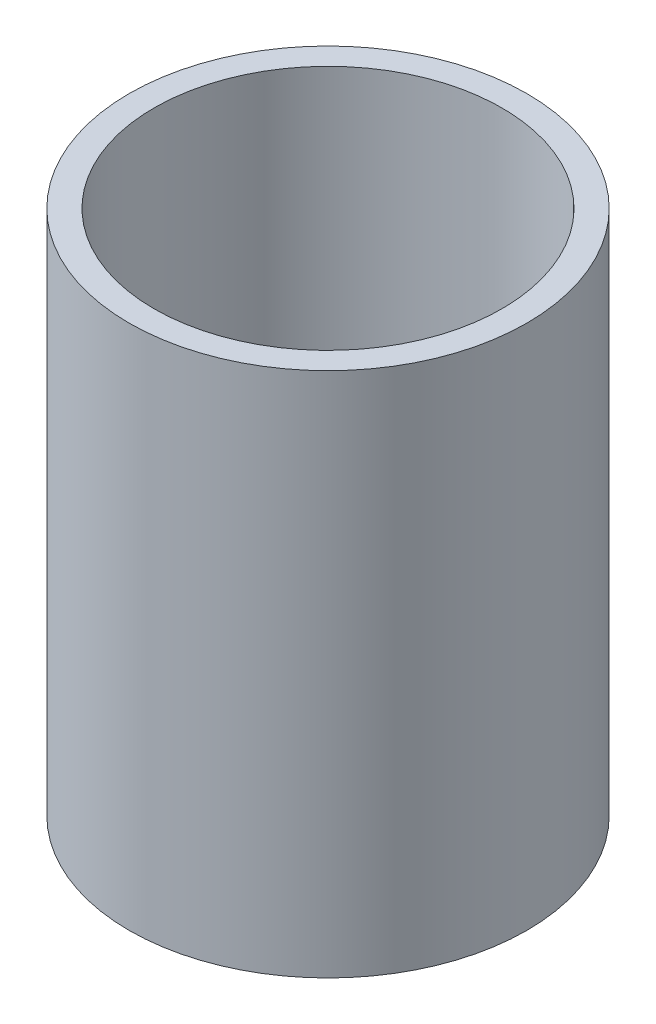
ISO-10303-21;
HEADER;
FILE_DESCRIPTION(('STEP AP214'),'2;1');
FILE_NAME('part.step','',(''),(''),'','','');
FILE_SCHEMA(('AUTOMOTIVE_DESIGN { 1 0 10303 214 1 1 1 1 }'));
ENDSEC;
DATA;
#1=APPLICATION_CONTEXT('core data for automotive mechanical design processes');
#2=APPLICATION_PROTOCOL_DEFINITION('international standard','automotive_design',2000,#1);
#3=PRODUCT_CONTEXT('',#1,'mechanical');
#4=PRODUCT('Part','Part','',(#3));
#5=PRODUCT_RELATED_PRODUCT_CATEGORY('part','',(#4));
#6=PRODUCT_DEFINITION_FORMATION('','',#4);
#7=PRODUCT_DEFINITION_CONTEXT('part definition',#1,'design');
#8=PRODUCT_DEFINITION('design','',#6,#7);
#9=PRODUCT_DEFINITION_SHAPE('','',#8);
#10=(LENGTH_UNIT() NAMED_UNIT(*) SI_UNIT(.MILLI.,.METRE.));
#11=(NAMED_UNIT(*) PLANE_ANGLE_UNIT() SI_UNIT($,.RADIAN.));
#12=(NAMED_UNIT(*) SI_UNIT($,.STERADIAN.) SOLID_ANGLE_UNIT());
#13=UNCERTAINTY_MEASURE_WITH_UNIT(LENGTH_MEASURE(1.E-05),#10,'distance_accuracy_value','');
#14=(GEOMETRIC_REPRESENTATION_CONTEXT(3) GLOBAL_UNCERTAINTY_ASSIGNED_CONTEXT((#13)) GLOBAL_UNIT_ASSIGNED_CONTEXT((#10,
#11,#12)) REPRESENTATION_CONTEXT('',''));
#15=CARTESIAN_POINT('',(0.,0.,0.));
#16=DIRECTION('',(0.,0.,1.));
#17=DIRECTION('',(1.,0.,0.));
#18=AXIS2_PLACEMENT_3D('',#15,#16,#17);
#19=CARTESIAN_POINT('',(0.,79.3533916089108,0.));
#20=DIRECTION('',(0.,-1.,0.));
#21=DIRECTION('',(0.,0.,-1.));
#22=AXIS2_PLACEMENT_3D('',#19,#20,#21);
#23=CYLINDRICAL_SURFACE('',#22,30.);
#24=CARTESIAN_POINT('',(0.,79.3533916089108,0.));
#25=DIRECTION('',(0.,1.,0.));
#26=DIRECTION('',(0.,0.,1.));
#27=AXIS2_PLACEMENT_3D('',#24,#25,#26);
#28=CIRCLE('',#27,30.);
#29=CARTESIAN_POINT('',(0.,79.3533916089108,30.));
#30=VERTEX_POINT('',#29);
#31=EDGE_CURVE('E10',#30,#30,#28,.T.);
#32=ORIENTED_EDGE('',*,*,#31,.F.);
#33=EDGE_LOOP('',(#32));
#34=FACE_BOUND('',#33,.T.);
#35=CARTESIAN_POINT('',(0.,0.,0.));
#36=DIRECTION('',(0.,1.,0.));
#37=DIRECTION('',(0.,0.,1.));
#38=AXIS2_PLACEMENT_3D('',#35,#36,#37);
#39=CIRCLE('',#38,30.);
#40=CARTESIAN_POINT('',(0.,0.,30.));
#41=VERTEX_POINT('',#40);
#42=EDGE_CURVE('E37',#41,#41,#39,.T.);
#43=ORIENTED_EDGE('',*,*,#42,.T.);
#44=EDGE_LOOP('',(#43));
#45=FACE_BOUND('',#44,.T.);
#46=ADVANCED_FACE('F40',(#34,#45),#23,.T.);
#47=CARTESIAN_POINT('',(0.,79.3533916089108,0.));
#48=DIRECTION('',(0.,1.,0.));
#49=DIRECTION('',(0.,0.,1.));
#50=AXIS2_PLACEMENT_3D('',#47,#48,#49);
#51=PLANE('',#50);
#52=CARTESIAN_POINT('',(0.,79.3533916089108,0.));
#53=DIRECTION('',(0.,1.,0.));
#54=DIRECTION('',(0.,0.,1.));
#55=AXIS2_PLACEMENT_3D('',#52,#53,#54);
#56=CIRCLE('',#55,26.2496500829708);
#57=CARTESIAN_POINT('',(0.,79.3533916089108,26.2496500829708));
#58=VERTEX_POINT('',#57);
#59=EDGE_CURVE('E50',#58,#58,#56,.T.);
#60=ORIENTED_EDGE('',*,*,#59,.F.);
#61=EDGE_LOOP('',(#60));
#62=FACE_BOUND('',#61,.T.);
#63=ORIENTED_EDGE('',*,*,#31,.T.);
#64=EDGE_LOOP('',(#63));
#65=FACE_BOUND('',#64,.T.);
#66=ADVANCED_FACE('F59',(#62,#65),#51,.T.);
#67=CARTESIAN_POINT('',(0.,0.,0.));
#68=DIRECTION('',(0.,1.,0.));
#69=DIRECTION('',(0.,0.,1.));
#70=AXIS2_PLACEMENT_3D('',#67,#68,#69);
#71=PLANE('',#70);
#72=CARTESIAN_POINT('',(0.,0.,0.));
#73=DIRECTION('',(0.,1.,0.));
#74=DIRECTION('',(0.,0.,1.));
#75=AXIS2_PLACEMENT_3D('',#72,#73,#74);
#76=CIRCLE('',#75,26.2496500829708);
#77=CARTESIAN_POINT('',(0.,0.,26.2496500829708));
#78=VERTEX_POINT('',#77);
#79=EDGE_CURVE('E47',#78,#78,#76,.T.);
#80=ORIENTED_EDGE('',*,*,#79,.T.);
#81=EDGE_LOOP('',(#80));
#82=FACE_BOUND('',#81,.T.);
#83=ORIENTED_EDGE('',*,*,#42,.F.);
#84=EDGE_LOOP('',(#83));
#85=FACE_BOUND('',#84,.T.);
#86=ADVANCED_FACE('F58',(#82,#85),#71,.F.);
#87=CARTESIAN_POINT('',(0.,79.3533916089108,0.));
#88=DIRECTION('',(0.,-1.,0.));
#89=DIRECTION('',(0.,0.,-1.));
#90=AXIS2_PLACEMENT_3D('',#87,#88,#89);
#91=CYLINDRICAL_SURFACE('',#90,26.2496500829708);
#92=ORIENTED_EDGE('',*,*,#59,.T.);
#93=EDGE_LOOP('',(#92));
#94=FACE_BOUND('',#93,.T.);
#95=ORIENTED_EDGE('',*,*,#79,.F.);
#96=EDGE_LOOP('',(#95));
#97=FACE_BOUND('',#96,.T.);
#98=ADVANCED_FACE('F54',(#94,#97),#91,.F.);
#99=CLOSED_SHELL('',(#46,#66,#86,#98));
#100=MANIFOLD_SOLID_BREP('B2',#99);
#101=ADVANCED_BREP_SHAPE_REPRESENTATION('',(#18,#100),#14);
#102=SHAPE_DEFINITION_REPRESENTATION(#9,#101);
ENDSEC;
END-ISO-10303-21;
